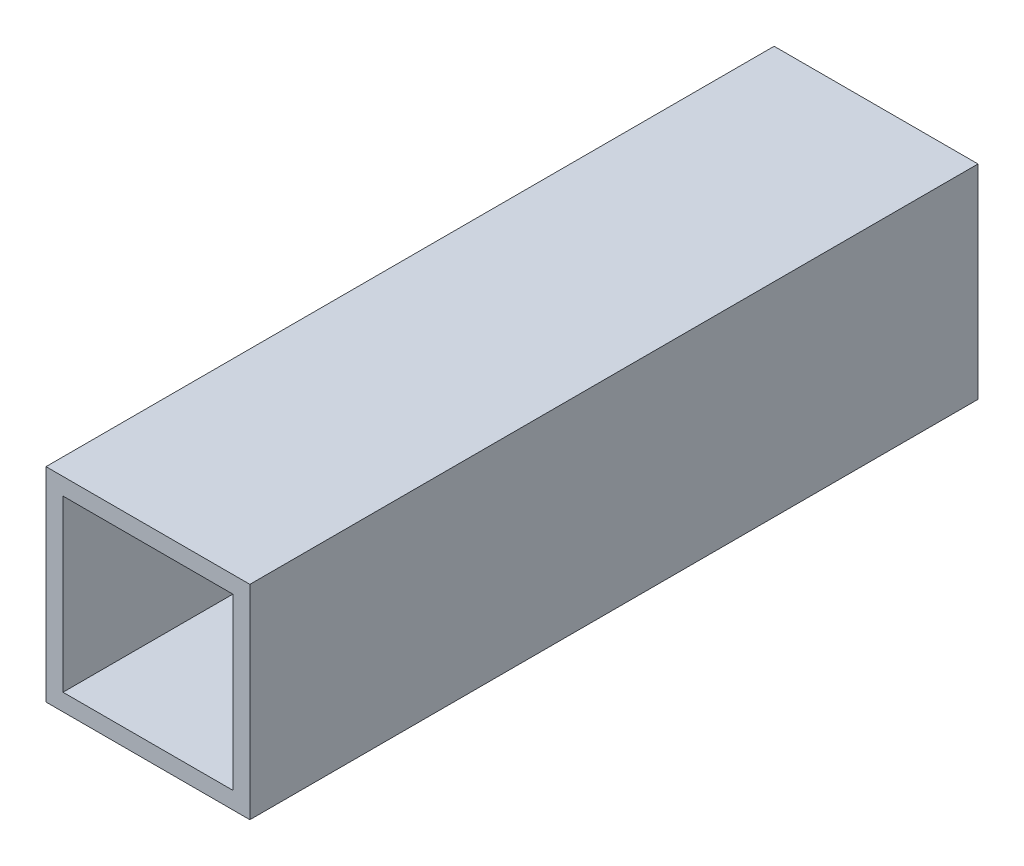
ISO-10303-21;
HEADER;
FILE_DESCRIPTION(('STEP AP214'),'2;1');
FILE_NAME('part.step','',(''),(''),'','','');
FILE_SCHEMA(('AUTOMOTIVE_DESIGN { 1 0 10303 214 1 1 1 1 }'));
ENDSEC;
DATA;
#1=APPLICATION_CONTEXT('core data for automotive mechanical design processes');
#2=APPLICATION_PROTOCOL_DEFINITION('international standard','automotive_design',2000,#1);
#3=PRODUCT_CONTEXT('',#1,'mechanical');
#4=PRODUCT('Part','Part','',(#3));
#5=PRODUCT_RELATED_PRODUCT_CATEGORY('part','',(#4));
#6=PRODUCT_DEFINITION_FORMATION('','',#4);
#7=PRODUCT_DEFINITION_CONTEXT('part definition',#1,'design');
#8=PRODUCT_DEFINITION('design','',#6,#7);
#9=PRODUCT_DEFINITION_SHAPE('','',#8);
#10=(LENGTH_UNIT() NAMED_UNIT(*) SI_UNIT(.MILLI.,.METRE.));
#11=(NAMED_UNIT(*) PLANE_ANGLE_UNIT() SI_UNIT($,.RADIAN.));
#12=(NAMED_UNIT(*) SI_UNIT($,.STERADIAN.) SOLID_ANGLE_UNIT());
#13=UNCERTAINTY_MEASURE_WITH_UNIT(LENGTH_MEASURE(1.E-05),#10,'distance_accuracy_value','');
#14=(GEOMETRIC_REPRESENTATION_CONTEXT(3) GLOBAL_UNCERTAINTY_ASSIGNED_CONTEXT((#13)) GLOBAL_UNIT_ASSIGNED_CONTEXT((#10,
#11,#12)) REPRESENTATION_CONTEXT('',''));
#15=CARTESIAN_POINT('',(0.,0.,0.));
#16=DIRECTION('',(0.,0.,1.));
#17=DIRECTION('',(1.,0.,0.));
#18=AXIS2_PLACEMENT_3D('',#15,#16,#17);
#19=CARTESIAN_POINT('',(-6.3,-6.3,45.));
#20=DIRECTION('',(1.,0.,0.));
#21=DIRECTION('',(0.,0.,-1.));
#22=AXIS2_PLACEMENT_3D('',#19,#20,#21);
#23=PLANE('',#22);
#24=DIRECTION('',(0.,-1.,0.));
#25=VECTOR('',#24,1.);
#26=CARTESIAN_POINT('',(-6.3,-6.3,0.));
#27=LINE('',#26,#25);
#28=CARTESIAN_POINT('',(-6.3,6.3,0.));
#29=VERTEX_POINT('',#28);
#30=CARTESIAN_POINT('',(-6.3,-6.3,0.));
#31=VERTEX_POINT('',#30);
#32=EDGE_CURVE('E141',#29,#31,#27,.T.);
#33=ORIENTED_EDGE('',*,*,#32,.T.);
#34=DIRECTION('',(0.,0.,-1.));
#35=VECTOR('',#34,1.);
#36=CARTESIAN_POINT('',(-6.3,-6.3,45.));
#37=LINE('',#36,#35);
#38=CARTESIAN_POINT('',(-6.3,-6.3,45.));
#39=VERTEX_POINT('',#38);
#40=EDGE_CURVE('E12',#39,#31,#37,.T.);
#41=ORIENTED_EDGE('',*,*,#40,.F.);
#42=DIRECTION('',(0.,-1.,0.));
#43=VECTOR('',#42,1.);
#44=CARTESIAN_POINT('',(-6.3,-6.3,45.));
#45=LINE('',#44,#43);
#46=CARTESIAN_POINT('',(-6.3,6.3,45.));
#47=VERTEX_POINT('',#46);
#48=EDGE_CURVE('E143',#47,#39,#45,.T.);
#49=ORIENTED_EDGE('',*,*,#48,.F.);
#50=DIRECTION('',(0.,0.,-1.));
#51=VECTOR('',#50,1.);
#52=CARTESIAN_POINT('',(-6.3,6.3,45.));
#53=LINE('',#52,#51);
#54=EDGE_CURVE('E149',#47,#29,#53,.T.);
#55=ORIENTED_EDGE('',*,*,#54,.T.);
#56=EDGE_LOOP('',(#33,#41,#49,#55));
#57=FACE_BOUND('',#56,.T.);
#58=ADVANCED_FACE('F35',(#57),#23,.F.);
#59=CARTESIAN_POINT('',(6.3,-6.3,45.));
#60=DIRECTION('',(0.,1.,0.));
#61=DIRECTION('',(-1.,0.,0.));
#62=AXIS2_PLACEMENT_3D('',#59,#60,#61);
#63=PLANE('',#62);
#64=DIRECTION('',(1.,0.,0.));
#65=VECTOR('',#64,1.);
#66=CARTESIAN_POINT('',(6.3,-6.3,0.));
#67=LINE('',#66,#65);
#68=CARTESIAN_POINT('',(6.3,-6.3,0.));
#69=VERTEX_POINT('',#68);
#70=EDGE_CURVE('E152',#31,#69,#67,.T.);
#71=ORIENTED_EDGE('',*,*,#70,.T.);
#72=DIRECTION('',(0.,0.,-1.));
#73=VECTOR('',#72,1.);
#74=CARTESIAN_POINT('',(6.3,-6.3,45.));
#75=LINE('',#74,#73);
#76=CARTESIAN_POINT('',(6.3,-6.3,45.));
#77=VERTEX_POINT('',#76);
#78=EDGE_CURVE('E42',#77,#69,#75,.T.);
#79=ORIENTED_EDGE('',*,*,#78,.F.);
#80=DIRECTION('',(1.,0.,0.));
#81=VECTOR('',#80,1.);
#82=CARTESIAN_POINT('',(6.3,-6.3,45.));
#83=LINE('',#82,#81);
#84=EDGE_CURVE('E86',#39,#77,#83,.T.);
#85=ORIENTED_EDGE('',*,*,#84,.F.);
#86=ORIENTED_EDGE('',*,*,#40,.T.);
#87=EDGE_LOOP('',(#71,#79,#85,#86));
#88=FACE_BOUND('',#87,.T.);
#89=ADVANCED_FACE('F179',(#88),#63,.F.);
#90=CARTESIAN_POINT('',(6.3,-6.3,45.));
#91=DIRECTION('',(-1.,0.,0.));
#92=DIRECTION('',(0.,0.,1.));
#93=AXIS2_PLACEMENT_3D('',#90,#91,#92);
#94=PLANE('',#93);
#95=DIRECTION('',(0.,1.,0.));
#96=VECTOR('',#95,1.);
#97=CARTESIAN_POINT('',(6.3,-6.3,0.));
#98=LINE('',#97,#96);
#99=CARTESIAN_POINT('',(6.3,6.3,0.));
#100=VERTEX_POINT('',#99);
#101=EDGE_CURVE('E154',#69,#100,#98,.T.);
#102=ORIENTED_EDGE('',*,*,#101,.T.);
#103=DIRECTION('',(0.,0.,-1.));
#104=VECTOR('',#103,1.);
#105=CARTESIAN_POINT('',(6.3,6.3,45.));
#106=LINE('',#105,#104);
#107=CARTESIAN_POINT('',(6.3,6.3,45.));
#108=VERTEX_POINT('',#107);
#109=EDGE_CURVE('E158',#108,#100,#106,.T.);
#110=ORIENTED_EDGE('',*,*,#109,.F.);
#111=DIRECTION('',(0.,1.,0.));
#112=VECTOR('',#111,1.);
#113=CARTESIAN_POINT('',(6.3,-6.3,45.));
#114=LINE('',#113,#112);
#115=EDGE_CURVE('E146',#77,#108,#114,.T.);
#116=ORIENTED_EDGE('',*,*,#115,.F.);
#117=ORIENTED_EDGE('',*,*,#78,.T.);
#118=EDGE_LOOP('',(#102,#110,#116,#117));
#119=FACE_BOUND('',#118,.T.);
#120=ADVANCED_FACE('F163',(#119),#94,.F.);
#121=CARTESIAN_POINT('',(6.3,6.3,45.));
#122=DIRECTION('',(0.,-1.,0.));
#123=DIRECTION('',(1.,0.,0.));
#124=AXIS2_PLACEMENT_3D('',#121,#122,#123);
#125=PLANE('',#124);
#126=DIRECTION('',(-1.,0.,0.));
#127=VECTOR('',#126,1.);
#128=CARTESIAN_POINT('',(6.3,6.3,0.));
#129=LINE('',#128,#127);
#130=EDGE_CURVE('E79',#100,#29,#129,.T.);
#131=ORIENTED_EDGE('',*,*,#130,.T.);
#132=ORIENTED_EDGE('',*,*,#54,.F.);
#133=DIRECTION('',(-1.,0.,0.));
#134=VECTOR('',#133,1.);
#135=CARTESIAN_POINT('',(6.3,6.3,45.));
#136=LINE('',#135,#134);
#137=EDGE_CURVE('E58',#108,#47,#136,.T.);
#138=ORIENTED_EDGE('',*,*,#137,.F.);
#139=ORIENTED_EDGE('',*,*,#109,.T.);
#140=EDGE_LOOP('',(#131,#132,#138,#139));
#141=FACE_BOUND('',#140,.T.);
#142=ADVANCED_FACE('F171',(#141),#125,.F.);
#143=CARTESIAN_POINT('',(0.,0.,45.));
#144=DIRECTION('',(0.,0.,1.));
#145=DIRECTION('',(1.,0.,0.));
#146=AXIS2_PLACEMENT_3D('',#143,#144,#145);
#147=PLANE('',#146);
#148=DIRECTION('',(0.,-1.,0.));
#149=VECTOR('',#148,1.);
#150=CARTESIAN_POINT('',(-5.25,-5.25,45.));
#151=LINE('',#150,#149);
#152=CARTESIAN_POINT('',(-5.25,5.25,45.));
#153=VERTEX_POINT('',#152);
#154=CARTESIAN_POINT('',(-5.25,-5.25,45.));
#155=VERTEX_POINT('',#154);
#156=EDGE_CURVE('E49',#153,#155,#151,.T.);
#157=ORIENTED_EDGE('',*,*,#156,.F.);
#158=DIRECTION('',(-1.,0.,0.));
#159=VECTOR('',#158,1.);
#160=CARTESIAN_POINT('',(5.25,5.25,45.));
#161=LINE('',#160,#159);
#162=CARTESIAN_POINT('',(5.25,5.25,45.));
#163=VERTEX_POINT('',#162);
#164=EDGE_CURVE('E130',#163,#153,#161,.T.);
#165=ORIENTED_EDGE('',*,*,#164,.F.);
#166=DIRECTION('',(0.,1.,0.));
#167=VECTOR('',#166,1.);
#168=CARTESIAN_POINT('',(5.25,-5.25,45.));
#169=LINE('',#168,#167);
#170=CARTESIAN_POINT('',(5.25,-5.25,45.));
#171=VERTEX_POINT('',#170);
#172=EDGE_CURVE('E114',#171,#163,#169,.T.);
#173=ORIENTED_EDGE('',*,*,#172,.F.);
#174=DIRECTION('',(1.,0.,0.));
#175=VECTOR('',#174,1.);
#176=CARTESIAN_POINT('',(5.25,-5.25,45.));
#177=LINE('',#176,#175);
#178=EDGE_CURVE('E124',#155,#171,#177,.T.);
#179=ORIENTED_EDGE('',*,*,#178,.F.);
#180=EDGE_LOOP('',(#157,#165,#173,#179));
#181=FACE_BOUND('',#180,.T.);
#182=ORIENTED_EDGE('',*,*,#48,.T.);
#183=ORIENTED_EDGE('',*,*,#84,.T.);
#184=ORIENTED_EDGE('',*,*,#115,.T.);
#185=ORIENTED_EDGE('',*,*,#137,.T.);
#186=EDGE_LOOP('',(#182,#183,#184,#185));
#187=FACE_BOUND('',#186,.T.);
#188=ADVANCED_FACE('F128',(#181,#187),#147,.T.);
#189=CARTESIAN_POINT('',(0.,0.,0.));
#190=DIRECTION('',(0.,0.,1.));
#191=DIRECTION('',(1.,0.,0.));
#192=AXIS2_PLACEMENT_3D('',#189,#190,#191);
#193=PLANE('',#192);
#194=ORIENTED_EDGE('',*,*,#32,.F.);
#195=ORIENTED_EDGE('',*,*,#130,.F.);
#196=ORIENTED_EDGE('',*,*,#101,.F.);
#197=ORIENTED_EDGE('',*,*,#70,.F.);
#198=EDGE_LOOP('',(#194,#195,#196,#197));
#199=FACE_BOUND('',#198,.T.);
#200=ADVANCED_FACE('F167',(#199),#193,.F.);
#201=CARTESIAN_POINT('',(-5.25,-5.25,-14.8492424049175));
#202=DIRECTION('',(-1.,0.,0.));
#203=DIRECTION('',(0.,0.,1.));
#204=AXIS2_PLACEMENT_3D('',#201,#202,#203);
#205=PLANE('',#204);
#206=DIRECTION('',(0.,1.,0.));
#207=VECTOR('',#206,1.);
#208=CARTESIAN_POINT('',(-5.25,-5.25,1.5));
#209=LINE('',#208,#207);
#210=CARTESIAN_POINT('',(-5.25,-5.25,1.5));
#211=VERTEX_POINT('',#210);
#212=CARTESIAN_POINT('',(-5.25,5.25,1.5));
#213=VERTEX_POINT('',#212);
#214=EDGE_CURVE('E142',#211,#213,#209,.T.);
#215=ORIENTED_EDGE('',*,*,#214,.T.);
#216=DIRECTION('',(0.,0.,1.));
#217=VECTOR('',#216,1.);
#218=CARTESIAN_POINT('',(-5.25,5.25,-14.8492424049175));
#219=LINE('',#218,#217);
#220=EDGE_CURVE('E135',#213,#153,#219,.T.);
#221=ORIENTED_EDGE('',*,*,#220,.T.);
#222=ORIENTED_EDGE('',*,*,#156,.T.);
#223=DIRECTION('',(0.,0.,1.));
#224=VECTOR('',#223,1.);
#225=CARTESIAN_POINT('',(-5.25,-5.25,-14.8492424049175));
#226=LINE('',#225,#224);
#227=EDGE_CURVE('E121',#211,#155,#226,.T.);
#228=ORIENTED_EDGE('',*,*,#227,.F.);
#229=EDGE_LOOP('',(#215,#221,#222,#228));
#230=FACE_BOUND('',#229,.T.);
#231=ADVANCED_FACE('F206',(#230),#205,.F.);
#232=CARTESIAN_POINT('',(5.25,5.25,-14.8492424049175));
#233=DIRECTION('',(0.,1.,0.));
#234=DIRECTION('',(-1.,0.,0.));
#235=AXIS2_PLACEMENT_3D('',#232,#233,#234);
#236=PLANE('',#235);
#237=DIRECTION('',(1.,0.,0.));
#238=VECTOR('',#237,1.);
#239=CARTESIAN_POINT('',(5.25,5.25,1.5));
#240=LINE('',#239,#238);
#241=CARTESIAN_POINT('',(5.25,5.25,1.5));
#242=VERTEX_POINT('',#241);
#243=EDGE_CURVE('E260',#213,#242,#240,.T.);
#244=ORIENTED_EDGE('',*,*,#243,.T.);
#245=DIRECTION('',(0.,0.,1.));
#246=VECTOR('',#245,1.);
#247=CARTESIAN_POINT('',(5.25,5.25,-14.8492424049175));
#248=LINE('',#247,#246);
#249=EDGE_CURVE('E120',#242,#163,#248,.T.);
#250=ORIENTED_EDGE('',*,*,#249,.T.);
#251=ORIENTED_EDGE('',*,*,#164,.T.);
#252=ORIENTED_EDGE('',*,*,#220,.F.);
#253=EDGE_LOOP('',(#244,#250,#251,#252));
#254=FACE_BOUND('',#253,.T.);
#255=ADVANCED_FACE('F219',(#254),#236,.F.);
#256=CARTESIAN_POINT('',(5.25,-5.25,-14.8492424049175));
#257=DIRECTION('',(1.,0.,0.));
#258=DIRECTION('',(0.,0.,-1.));
#259=AXIS2_PLACEMENT_3D('',#256,#257,#258);
#260=PLANE('',#259);
#261=DIRECTION('',(0.,-1.,0.));
#262=VECTOR('',#261,1.);
#263=CARTESIAN_POINT('',(5.25,-5.25,1.5));
#264=LINE('',#263,#262);
#265=CARTESIAN_POINT('',(5.25,-5.25,1.5));
#266=VERTEX_POINT('',#265);
#267=EDGE_CURVE('E117',#242,#266,#264,.T.);
#268=ORIENTED_EDGE('',*,*,#267,.T.);
#269=DIRECTION('',(0.,0.,1.));
#270=VECTOR('',#269,1.);
#271=CARTESIAN_POINT('',(5.25,-5.25,-14.8492424049175));
#272=LINE('',#271,#270);
#273=EDGE_CURVE('E109',#266,#171,#272,.T.);
#274=ORIENTED_EDGE('',*,*,#273,.T.);
#275=ORIENTED_EDGE('',*,*,#172,.T.);
#276=ORIENTED_EDGE('',*,*,#249,.F.);
#277=EDGE_LOOP('',(#268,#274,#275,#276));
#278=FACE_BOUND('',#277,.T.);
#279=ADVANCED_FACE('F111',(#278),#260,.F.);
#280=CARTESIAN_POINT('',(5.25,-5.25,-14.8492424049175));
#281=DIRECTION('',(0.,-1.,0.));
#282=DIRECTION('',(1.,0.,0.));
#283=AXIS2_PLACEMENT_3D('',#280,#281,#282);
#284=PLANE('',#283);
#285=DIRECTION('',(-1.,0.,0.));
#286=VECTOR('',#285,1.);
#287=CARTESIAN_POINT('',(5.25,-5.25,1.5));
#288=LINE('',#287,#286);
#289=EDGE_CURVE('E139',#266,#211,#288,.T.);
#290=ORIENTED_EDGE('',*,*,#289,.T.);
#291=ORIENTED_EDGE('',*,*,#227,.T.);
#292=ORIENTED_EDGE('',*,*,#178,.T.);
#293=ORIENTED_EDGE('',*,*,#273,.F.);
#294=EDGE_LOOP('',(#290,#291,#292,#293));
#295=FACE_BOUND('',#294,.T.);
#296=ADVANCED_FACE('F125',(#295),#284,.F.);
#297=CARTESIAN_POINT('',(0.,0.,1.5));
#298=DIRECTION('',(0.,0.,1.));
#299=DIRECTION('',(1.,0.,0.));
#300=AXIS2_PLACEMENT_3D('',#297,#298,#299);
#301=PLANE('',#300);
#302=ORIENTED_EDGE('',*,*,#214,.F.);
#303=ORIENTED_EDGE('',*,*,#289,.F.);
#304=ORIENTED_EDGE('',*,*,#267,.F.);
#305=ORIENTED_EDGE('',*,*,#243,.F.);
#306=EDGE_LOOP('',(#302,#303,#304,#305));
#307=FACE_BOUND('',#306,.T.);
#308=ADVANCED_FACE('F245',(#307),#301,.T.);
#309=CLOSED_SHELL('',(#58,#89,#120,#142,#188,#200,#231,#255,#279,#296,#308));
#310=MANIFOLD_SOLID_BREP('B2',#309);
#311=ADVANCED_BREP_SHAPE_REPRESENTATION('',(#18,#310),#14);
#312=SHAPE_DEFINITION_REPRESENTATION(#9,#311);
ENDSEC;
END-ISO-10303-21;
